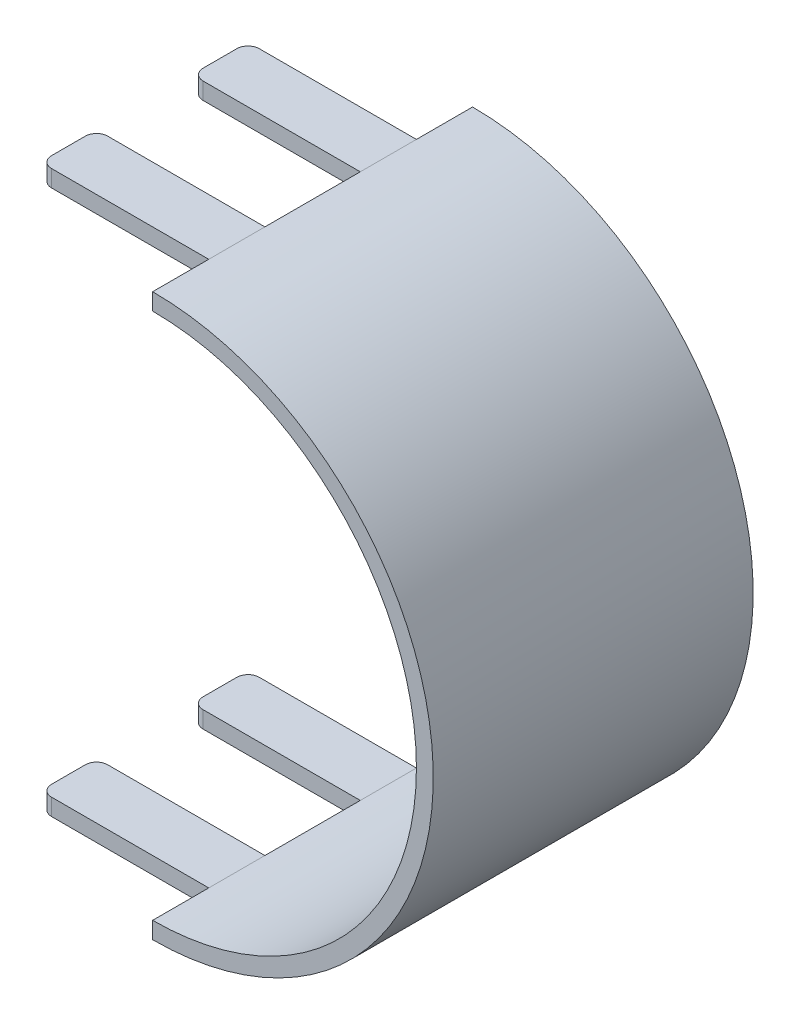
ISO-10303-21;
HEADER;
FILE_DESCRIPTION(('STEP AP214'),'2;1');
FILE_NAME('part.step','',(''),(''),'','','');
FILE_SCHEMA(('AUTOMOTIVE_DESIGN { 1 0 10303 214 1 1 1 1 }'));
ENDSEC;
DATA;
#1=APPLICATION_CONTEXT('core data for automotive mechanical design processes');
#2=APPLICATION_PROTOCOL_DEFINITION('international standard','automotive_design',2000,#1);
#3=PRODUCT_CONTEXT('',#1,'mechanical');
#4=PRODUCT('Part','Part','',(#3));
#5=PRODUCT_RELATED_PRODUCT_CATEGORY('part','',(#4));
#6=PRODUCT_DEFINITION_FORMATION('','',#4);
#7=PRODUCT_DEFINITION_CONTEXT('part definition',#1,'design');
#8=PRODUCT_DEFINITION('design','',#6,#7);
#9=PRODUCT_DEFINITION_SHAPE('','',#8);
#10=(LENGTH_UNIT() NAMED_UNIT(*) SI_UNIT(.MILLI.,.METRE.));
#11=(NAMED_UNIT(*) PLANE_ANGLE_UNIT() SI_UNIT($,.RADIAN.));
#12=(NAMED_UNIT(*) SI_UNIT($,.STERADIAN.) SOLID_ANGLE_UNIT());
#13=UNCERTAINTY_MEASURE_WITH_UNIT(LENGTH_MEASURE(1.E-05),#10,'distance_accuracy_value','');
#14=(GEOMETRIC_REPRESENTATION_CONTEXT(3) GLOBAL_UNCERTAINTY_ASSIGNED_CONTEXT((#13)) GLOBAL_UNIT_ASSIGNED_CONTEXT((#10,
#11,#12)) REPRESENTATION_CONTEXT('',''));
#15=CARTESIAN_POINT('',(0.,0.,0.));
#16=DIRECTION('',(0.,0.,1.));
#17=DIRECTION('',(1.,0.,0.));
#18=AXIS2_PLACEMENT_3D('',#15,#16,#17);
#19=CARTESIAN_POINT('',(300.,0.,60.));
#20=DIRECTION('',(0.,0.,-1.));
#21=DIRECTION('',(-1.,0.,0.));
#22=AXIS2_PLACEMENT_3D('',#19,#20,#21);
#23=CYLINDRICAL_SURFACE('',#22,50.);
#24=DIRECTION('',(0.,0.,-1.));
#25=VECTOR('',#24,1.);
#26=CARTESIAN_POINT('',(300.,-50.,60.));
#27=LINE('',#26,#25);
#28=CARTESIAN_POINT('',(300.,-50.,60.));
#29=VERTEX_POINT('',#28);
#30=CARTESIAN_POINT('',(300.,-50.,50.));
#31=VERTEX_POINT('',#30);
#32=EDGE_CURVE('E340',#29,#31,#27,.T.);
#33=ORIENTED_EDGE('',*,*,#32,.T.);
#34=DIRECTION('',(0.,0.,-1.));
#35=VECTOR('',#34,1.);
#36=CARTESIAN_POINT('',(300.,-50.,60.));
#37=LINE('',#36,#35);
#38=CARTESIAN_POINT('',(300.,-50.,40.));
#39=VERTEX_POINT('',#38);
#40=EDGE_CURVE('E260',#31,#39,#37,.T.);
#41=ORIENTED_EDGE('',*,*,#40,.T.);
#42=CARTESIAN_POINT('',(300.,-50.,23.));
#43=VERTEX_POINT('',#42);
#44=EDGE_CURVE('E350',#39,#43,#27,.T.);
#45=ORIENTED_EDGE('',*,*,#44,.T.);
#46=DIRECTION('',(0.,0.,-1.));
#47=VECTOR('',#46,1.);
#48=CARTESIAN_POINT('',(300.,-50.,60.));
#49=LINE('',#48,#47);
#50=CARTESIAN_POINT('',(300.,-50.,13.));
#51=VERTEX_POINT('',#50);
#52=EDGE_CURVE('E257',#43,#51,#49,.T.);
#53=ORIENTED_EDGE('',*,*,#52,.T.);
#54=CARTESIAN_POINT('',(300.,-50.,3.));
#55=VERTEX_POINT('',#54);
#56=EDGE_CURVE('E351',#51,#55,#27,.T.);
#57=ORIENTED_EDGE('',*,*,#56,.T.);
#58=CARTESIAN_POINT('',(300.,0.,3.));
#59=DIRECTION('',(0.,0.,1.));
#60=DIRECTION('',(1.,0.,0.));
#61=AXIS2_PLACEMENT_3D('',#58,#59,#60);
#62=CIRCLE('',#61,50.);
#63=CARTESIAN_POINT('',(300.,50.,3.));
#64=VERTEX_POINT('',#63);
#65=EDGE_CURVE('E344',#55,#64,#62,.T.);
#66=ORIENTED_EDGE('',*,*,#65,.T.);
#67=DIRECTION('',(0.,0.,-1.));
#68=VECTOR('',#67,1.);
#69=CARTESIAN_POINT('',(300.,50.,60.));
#70=LINE('',#69,#68);
#71=CARTESIAN_POINT('',(300.,50.,13.));
#72=VERTEX_POINT('',#71);
#73=EDGE_CURVE('E231',#72,#64,#70,.T.);
#74=ORIENTED_EDGE('',*,*,#73,.F.);
#75=DIRECTION('',(0.,0.,-1.));
#76=VECTOR('',#75,1.);
#77=CARTESIAN_POINT('',(300.,50.,60.));
#78=LINE('',#77,#76);
#79=CARTESIAN_POINT('',(300.,50.,23.));
#80=VERTEX_POINT('',#79);
#81=EDGE_CURVE('E235',#80,#72,#78,.T.);
#82=ORIENTED_EDGE('',*,*,#81,.F.);
#83=CARTESIAN_POINT('',(300.,50.,40.));
#84=VERTEX_POINT('',#83);
#85=EDGE_CURVE('E219',#84,#80,#70,.T.);
#86=ORIENTED_EDGE('',*,*,#85,.F.);
#87=DIRECTION('',(0.,0.,-1.));
#88=VECTOR('',#87,1.);
#89=CARTESIAN_POINT('',(300.,50.,60.));
#90=LINE('',#89,#88);
#91=CARTESIAN_POINT('',(300.,50.,50.));
#92=VERTEX_POINT('',#91);
#93=EDGE_CURVE('E316',#92,#84,#90,.T.);
#94=ORIENTED_EDGE('',*,*,#93,.F.);
#95=CARTESIAN_POINT('',(300.,50.,60.));
#96=VERTEX_POINT('',#95);
#97=EDGE_CURVE('E230',#96,#92,#70,.T.);
#98=ORIENTED_EDGE('',*,*,#97,.F.);
#99=CARTESIAN_POINT('',(300.,0.,60.));
#100=DIRECTION('',(0.,0.,1.));
#101=DIRECTION('',(1.,0.,0.));
#102=AXIS2_PLACEMENT_3D('',#99,#100,#101);
#103=CIRCLE('',#102,50.);
#104=EDGE_CURVE('E337',#29,#96,#103,.T.);
#105=ORIENTED_EDGE('',*,*,#104,.F.);
#106=EDGE_LOOP('',(#33,#41,#45,#53,#57,#66,#74,#82,#86,#94,#98,#105));
#107=FACE_BOUND('',#106,.T.);
#108=ADVANCED_FACE('F33',(#107),#23,.T.);
#109=CARTESIAN_POINT('',(300.,47.,3.));
#110=DIRECTION('',(0.,1.,0.));
#111=DIRECTION('',(0.,0.,1.));
#112=AXIS2_PLACEMENT_3D('',#109,#110,#111);
#113=PLANE('',#112);
#114=DIRECTION('',(0.,0.,1.));
#115=VECTOR('',#114,1.);
#116=CARTESIAN_POINT('',(270.,47.,3.));
#117=LINE('',#116,#115);
#118=CARTESIAN_POINT('',(270.,47.,15.));
#119=VERTEX_POINT('',#118);
#120=CARTESIAN_POINT('',(270.,47.,21.));
#121=VERTEX_POINT('',#120);
#122=EDGE_CURVE('E439',#119,#121,#117,.T.);
#123=ORIENTED_EDGE('',*,*,#122,.F.);
#124=CARTESIAN_POINT('',(272.,47.,15.));
#125=DIRECTION('',(0.,1.,0.));
#126=DIRECTION('',(0.,0.,1.));
#127=AXIS2_PLACEMENT_3D('',#124,#125,#126);
#128=CIRCLE('',#127,2.);
#129=CARTESIAN_POINT('',(272.,47.,13.));
#130=VERTEX_POINT('',#129);
#131=EDGE_CURVE('E41',#119,#130,#128,.F.);
#132=ORIENTED_EDGE('',*,*,#131,.T.);
#133=DIRECTION('',(-1.,0.,0.));
#134=VECTOR('',#133,1.);
#135=CARTESIAN_POINT('',(300.,47.,13.));
#136=LINE('',#135,#134);
#137=CARTESIAN_POINT('',(300.,47.,13.));
#138=VERTEX_POINT('',#137);
#139=EDGE_CURVE('E242',#138,#130,#136,.T.);
#140=ORIENTED_EDGE('',*,*,#139,.F.);
#141=DIRECTION('',(0.,0.,1.));
#142=VECTOR('',#141,1.);
#143=CARTESIAN_POINT('',(300.,47.,3.));
#144=LINE('',#143,#142);
#145=CARTESIAN_POINT('',(300.,47.,23.));
#146=VERTEX_POINT('',#145);
#147=EDGE_CURVE('E241',#138,#146,#144,.T.);
#148=ORIENTED_EDGE('',*,*,#147,.T.);
#149=DIRECTION('',(1.,0.,0.));
#150=VECTOR('',#149,1.);
#151=CARTESIAN_POINT('',(300.,47.,23.));
#152=LINE('',#151,#150);
#153=CARTESIAN_POINT('',(272.,47.,23.));
#154=VERTEX_POINT('',#153);
#155=EDGE_CURVE('E252',#154,#146,#152,.T.);
#156=ORIENTED_EDGE('',*,*,#155,.F.);
#157=CARTESIAN_POINT('',(272.,47.,21.));
#158=DIRECTION('',(0.,1.,0.));
#159=DIRECTION('',(0.,0.,1.));
#160=AXIS2_PLACEMENT_3D('',#157,#158,#159);
#161=CIRCLE('',#160,2.);
#162=EDGE_CURVE('E53',#154,#121,#161,.F.);
#163=ORIENTED_EDGE('',*,*,#162,.T.);
#164=EDGE_LOOP('',(#123,#132,#140,#148,#156,#163));
#165=FACE_BOUND('',#164,.T.);
#166=ADVANCED_FACE('F437',(#165),#113,.F.);
#167=CARTESIAN_POINT('',(300.,47.,3.));
#168=DIRECTION('',(0.,1.,0.));
#169=DIRECTION('',(0.,0.,1.));
#170=AXIS2_PLACEMENT_3D('',#167,#168,#169);
#171=PLANE('',#170);
#172=DIRECTION('',(1.,0.,0.));
#173=VECTOR('',#172,1.);
#174=CARTESIAN_POINT('',(300.,47.,50.));
#175=LINE('',#174,#173);
#176=CARTESIAN_POINT('',(272.,47.,50.));
#177=VERTEX_POINT('',#176);
#178=CARTESIAN_POINT('',(300.,47.,50.));
#179=VERTEX_POINT('',#178);
#180=EDGE_CURVE('E324',#177,#179,#175,.T.);
#181=ORIENTED_EDGE('',*,*,#180,.F.);
#182=CARTESIAN_POINT('',(272.,47.,48.));
#183=DIRECTION('',(0.,1.,0.));
#184=DIRECTION('',(0.,0.,1.));
#185=AXIS2_PLACEMENT_3D('',#182,#183,#184);
#186=CIRCLE('',#185,2.);
#187=CARTESIAN_POINT('',(270.,47.,48.));
#188=VERTEX_POINT('',#187);
#189=EDGE_CURVE('E418',#177,#188,#186,.F.);
#190=ORIENTED_EDGE('',*,*,#189,.T.);
#191=DIRECTION('',(0.,0.,1.));
#192=VECTOR('',#191,1.);
#193=CARTESIAN_POINT('',(270.,47.,3.));
#194=LINE('',#193,#192);
#195=CARTESIAN_POINT('',(270.,47.,42.));
#196=VERTEX_POINT('',#195);
#197=EDGE_CURVE('E321',#196,#188,#194,.T.);
#198=ORIENTED_EDGE('',*,*,#197,.F.);
#199=CARTESIAN_POINT('',(272.,47.,42.));
#200=DIRECTION('',(0.,1.,0.));
#201=DIRECTION('',(0.,0.,1.));
#202=AXIS2_PLACEMENT_3D('',#199,#200,#201);
#203=CIRCLE('',#202,2.);
#204=CARTESIAN_POINT('',(272.,47.,40.));
#205=VERTEX_POINT('',#204);
#206=EDGE_CURVE('E416',#196,#205,#203,.F.);
#207=ORIENTED_EDGE('',*,*,#206,.T.);
#208=DIRECTION('',(-1.,0.,0.));
#209=VECTOR('',#208,1.);
#210=CARTESIAN_POINT('',(300.,47.,40.));
#211=LINE('',#210,#209);
#212=CARTESIAN_POINT('',(300.,47.,40.));
#213=VERTEX_POINT('',#212);
#214=EDGE_CURVE('E318',#213,#205,#211,.T.);
#215=ORIENTED_EDGE('',*,*,#214,.F.);
#216=DIRECTION('',(0.,0.,1.));
#217=VECTOR('',#216,1.);
#218=CARTESIAN_POINT('',(300.,47.,3.));
#219=LINE('',#218,#217);
#220=EDGE_CURVE('E312',#213,#179,#219,.T.);
#221=ORIENTED_EDGE('',*,*,#220,.T.);
#222=EDGE_LOOP('',(#181,#190,#198,#207,#215,#221));
#223=FACE_BOUND('',#222,.T.);
#224=ADVANCED_FACE('F557',(#223),#171,.F.);
#225=CARTESIAN_POINT('',(-300.,-47.,3.));
#226=DIRECTION('',(0.,-1.,0.));
#227=DIRECTION('',(0.,0.,-1.));
#228=AXIS2_PLACEMENT_3D('',#225,#226,#227);
#229=PLANE('',#228);
#230=DIRECTION('',(0.,0.,-1.));
#231=VECTOR('',#230,1.);
#232=CARTESIAN_POINT('',(270.,-47.,3.));
#233=LINE('',#232,#231);
#234=CARTESIAN_POINT('',(270.,-47.,48.));
#235=VERTEX_POINT('',#234);
#236=CARTESIAN_POINT('',(270.,-47.,42.));
#237=VERTEX_POINT('',#236);
#238=EDGE_CURVE('E298',#235,#237,#233,.T.);
#239=ORIENTED_EDGE('',*,*,#238,.F.);
#240=CARTESIAN_POINT('',(272.,-47.,48.));
#241=DIRECTION('',(0.,-1.,0.));
#242=DIRECTION('',(0.,0.,-1.));
#243=AXIS2_PLACEMENT_3D('',#240,#241,#242);
#244=CIRCLE('',#243,2.);
#245=CARTESIAN_POINT('',(272.,-47.,50.));
#246=VERTEX_POINT('',#245);
#247=EDGE_CURVE('E376',#235,#246,#244,.F.);
#248=ORIENTED_EDGE('',*,*,#247,.T.);
#249=DIRECTION('',(-1.,0.,0.));
#250=VECTOR('',#249,1.);
#251=CARTESIAN_POINT('',(-300.,-47.,50.));
#252=LINE('',#251,#250);
#253=CARTESIAN_POINT('',(300.,-47.,50.));
#254=VERTEX_POINT('',#253);
#255=EDGE_CURVE('E297',#254,#246,#252,.T.);
#256=ORIENTED_EDGE('',*,*,#255,.F.);
#257=DIRECTION('',(0.,0.,1.));
#258=VECTOR('',#257,1.);
#259=CARTESIAN_POINT('',(300.,-47.,3.));
#260=LINE('',#259,#258);
#261=CARTESIAN_POINT('',(300.,-47.,40.));
#262=VERTEX_POINT('',#261);
#263=EDGE_CURVE('E285',#262,#254,#260,.T.);
#264=ORIENTED_EDGE('',*,*,#263,.F.);
#265=DIRECTION('',(1.,0.,0.));
#266=VECTOR('',#265,1.);
#267=CARTESIAN_POINT('',(-300.,-47.,40.));
#268=LINE('',#267,#266);
#269=CARTESIAN_POINT('',(272.,-47.,40.));
#270=VERTEX_POINT('',#269);
#271=EDGE_CURVE('E301',#270,#262,#268,.T.);
#272=ORIENTED_EDGE('',*,*,#271,.F.);
#273=CARTESIAN_POINT('',(272.,-47.,42.));
#274=DIRECTION('',(0.,-1.,0.));
#275=DIRECTION('',(0.,0.,-1.));
#276=AXIS2_PLACEMENT_3D('',#273,#274,#275);
#277=CIRCLE('',#276,2.);
#278=EDGE_CURVE('E374',#270,#237,#277,.F.);
#279=ORIENTED_EDGE('',*,*,#278,.T.);
#280=EDGE_LOOP('',(#239,#248,#256,#264,#272,#279));
#281=FACE_BOUND('',#280,.T.);
#282=ADVANCED_FACE('F524',(#281),#229,.F.);
#283=CARTESIAN_POINT('',(-300.,-47.,3.));
#284=DIRECTION('',(0.,-1.,0.));
#285=DIRECTION('',(0.,0.,-1.));
#286=AXIS2_PLACEMENT_3D('',#283,#284,#285);
#287=PLANE('',#286);
#288=DIRECTION('',(0.,0.,-1.));
#289=VECTOR('',#288,1.);
#290=CARTESIAN_POINT('',(270.,-47.,3.));
#291=LINE('',#290,#289);
#292=CARTESIAN_POINT('',(270.,-47.,21.));
#293=VERTEX_POINT('',#292);
#294=CARTESIAN_POINT('',(270.,-47.,15.));
#295=VERTEX_POINT('',#294);
#296=EDGE_CURVE('E273',#293,#295,#291,.T.);
#297=ORIENTED_EDGE('',*,*,#296,.F.);
#298=CARTESIAN_POINT('',(272.,-47.,21.));
#299=DIRECTION('',(0.,-1.,0.));
#300=DIRECTION('',(0.,0.,-1.));
#301=AXIS2_PLACEMENT_3D('',#298,#299,#300);
#302=CIRCLE('',#301,2.);
#303=CARTESIAN_POINT('',(272.,-47.,23.));
#304=VERTEX_POINT('',#303);
#305=EDGE_CURVE('E394',#293,#304,#302,.F.);
#306=ORIENTED_EDGE('',*,*,#305,.T.);
#307=DIRECTION('',(-1.,0.,0.));
#308=VECTOR('',#307,1.);
#309=CARTESIAN_POINT('',(-300.,-47.,23.));
#310=LINE('',#309,#308);
#311=CARTESIAN_POINT('',(300.,-47.,23.));
#312=VERTEX_POINT('',#311);
#313=EDGE_CURVE('E270',#312,#304,#310,.T.);
#314=ORIENTED_EDGE('',*,*,#313,.F.);
#315=DIRECTION('',(0.,0.,1.));
#316=VECTOR('',#315,1.);
#317=CARTESIAN_POINT('',(300.,-47.,3.));
#318=LINE('',#317,#316);
#319=CARTESIAN_POINT('',(300.,-47.,13.));
#320=VERTEX_POINT('',#319);
#321=EDGE_CURVE('E261',#320,#312,#318,.T.);
#322=ORIENTED_EDGE('',*,*,#321,.F.);
#323=DIRECTION('',(1.,0.,0.));
#324=VECTOR('',#323,1.);
#325=CARTESIAN_POINT('',(-300.,-47.,13.));
#326=LINE('',#325,#324);
#327=CARTESIAN_POINT('',(272.,-47.,13.));
#328=VERTEX_POINT('',#327);
#329=EDGE_CURVE('E276',#328,#320,#326,.T.);
#330=ORIENTED_EDGE('',*,*,#329,.F.);
#331=CARTESIAN_POINT('',(272.,-47.,15.));
#332=DIRECTION('',(0.,-1.,0.));
#333=DIRECTION('',(0.,0.,-1.));
#334=AXIS2_PLACEMENT_3D('',#331,#332,#333);
#335=CIRCLE('',#334,2.);
#336=EDGE_CURVE('E392',#328,#295,#335,.F.);
#337=ORIENTED_EDGE('',*,*,#336,.T.);
#338=EDGE_LOOP('',(#297,#306,#314,#322,#330,#337));
#339=FACE_BOUND('',#338,.T.);
#340=ADVANCED_FACE('F479',(#339),#287,.F.);
#341=CARTESIAN_POINT('',(270.,-50.01,13.));
#342=DIRECTION('',(-1.,0.,0.));
#343=DIRECTION('',(0.,0.,1.));
#344=AXIS2_PLACEMENT_3D('',#341,#342,#343);
#345=PLANE('',#344);
#346=DIRECTION('',(0.,0.,1.));
#347=VECTOR('',#346,1.);
#348=CARTESIAN_POINT('',(270.,-50.,60.));
#349=LINE('',#348,#347);
#350=CARTESIAN_POINT('',(270.,-50.,15.));
#351=VERTEX_POINT('',#350);
#352=CARTESIAN_POINT('',(270.,-50.,21.));
#353=VERTEX_POINT('',#352);
#354=EDGE_CURVE('E280',#351,#353,#349,.T.);
#355=ORIENTED_EDGE('',*,*,#354,.T.);
#356=DIRECTION('',(0.,1.,0.));
#357=VECTOR('',#356,1.);
#358=CARTESIAN_POINT('',(270.,-50.01,21.));
#359=LINE('',#358,#357);
#360=EDGE_CURVE('E389',#353,#293,#359,.T.);
#361=ORIENTED_EDGE('',*,*,#360,.T.);
#362=ORIENTED_EDGE('',*,*,#296,.T.);
#363=DIRECTION('',(0.,1.,0.));
#364=VECTOR('',#363,1.);
#365=CARTESIAN_POINT('',(270.,-50.01,15.));
#366=LINE('',#365,#364);
#367=EDGE_CURVE('E387',#295,#351,#366,.F.);
#368=ORIENTED_EDGE('',*,*,#367,.T.);
#369=EDGE_LOOP('',(#355,#361,#362,#368));
#370=FACE_BOUND('',#369,.T.);
#371=ADVANCED_FACE('F695',(#370),#345,.T.);
#372=CARTESIAN_POINT('',(300.,-50.01,23.));
#373=DIRECTION('',(0.,0.,1.));
#374=DIRECTION('',(1.,0.,0.));
#375=AXIS2_PLACEMENT_3D('',#372,#373,#374);
#376=PLANE('',#375);
#377=ORIENTED_EDGE('',*,*,#313,.T.);
#378=DIRECTION('',(0.,1.,0.));
#379=VECTOR('',#378,1.);
#380=CARTESIAN_POINT('',(272.,-50.01,23.));
#381=LINE('',#380,#379);
#382=CARTESIAN_POINT('',(272.,-50.,23.));
#383=VERTEX_POINT('',#382);
#384=EDGE_CURVE('E396',#304,#383,#381,.F.);
#385=ORIENTED_EDGE('',*,*,#384,.T.);
#386=DIRECTION('',(1.,0.,0.));
#387=VECTOR('',#386,1.);
#388=CARTESIAN_POINT('',(-300.,-50.,23.));
#389=LINE('',#388,#387);
#390=EDGE_CURVE('E278',#383,#43,#389,.T.);
#391=ORIENTED_EDGE('',*,*,#390,.T.);
#392=DIRECTION('',(0.,1.,0.));
#393=VECTOR('',#392,1.);
#394=CARTESIAN_POINT('',(300.,1.71683972880179E-13,23.));
#395=LINE('',#394,#393);
#396=EDGE_CURVE('E264',#43,#312,#395,.T.);
#397=ORIENTED_EDGE('',*,*,#396,.T.);
#398=EDGE_LOOP('',(#377,#385,#391,#397));
#399=FACE_BOUND('',#398,.T.);
#400=ADVANCED_FACE('F483',(#399),#376,.T.);
#401=CARTESIAN_POINT('',(300.,-50.01,13.));
#402=DIRECTION('',(0.,0.,-1.));
#403=DIRECTION('',(-1.,0.,0.));
#404=AXIS2_PLACEMENT_3D('',#401,#402,#403);
#405=PLANE('',#404);
#406=DIRECTION('',(-1.,0.,0.));
#407=VECTOR('',#406,1.);
#408=CARTESIAN_POINT('',(-300.,-50.,13.));
#409=LINE('',#408,#407);
#410=CARTESIAN_POINT('',(272.,-50.,13.));
#411=VERTEX_POINT('',#410);
#412=EDGE_CURVE('E263',#51,#411,#409,.T.);
#413=ORIENTED_EDGE('',*,*,#412,.T.);
#414=DIRECTION('',(0.,1.,0.));
#415=VECTOR('',#414,1.);
#416=CARTESIAN_POINT('',(272.,-50.01,13.));
#417=LINE('',#416,#415);
#418=EDGE_CURVE('E402',#411,#328,#417,.T.);
#419=ORIENTED_EDGE('',*,*,#418,.T.);
#420=ORIENTED_EDGE('',*,*,#329,.T.);
#421=DIRECTION('',(0.,-1.,0.));
#422=VECTOR('',#421,1.);
#423=CARTESIAN_POINT('',(300.,1.71683972880179E-13,13.));
#424=LINE('',#423,#422);
#425=EDGE_CURVE('E267',#320,#51,#424,.T.);
#426=ORIENTED_EDGE('',*,*,#425,.T.);
#427=EDGE_LOOP('',(#413,#419,#420,#426));
#428=FACE_BOUND('',#427,.T.);
#429=ADVANCED_FACE('F500',(#428),#405,.T.);
#430=CARTESIAN_POINT('',(-300.,-50.,60.));
#431=DIRECTION('',(0.,1.,0.));
#432=DIRECTION('',(0.,0.,1.));
#433=AXIS2_PLACEMENT_3D('',#430,#431,#432);
#434=PLANE('',#433);
#435=ORIENTED_EDGE('',*,*,#390,.F.);
#436=CARTESIAN_POINT('',(272.,-50.,21.));
#437=DIRECTION('',(0.,1.,0.));
#438=DIRECTION('',(0.,0.,1.));
#439=AXIS2_PLACEMENT_3D('',#436,#437,#438);
#440=CIRCLE('',#439,2.);
#441=EDGE_CURVE('E400',#383,#353,#440,.F.);
#442=ORIENTED_EDGE('',*,*,#441,.T.);
#443=ORIENTED_EDGE('',*,*,#354,.F.);
#444=CARTESIAN_POINT('',(272.,-50.,15.));
#445=DIRECTION('',(0.,1.,0.));
#446=DIRECTION('',(0.,0.,1.));
#447=AXIS2_PLACEMENT_3D('',#444,#445,#446);
#448=CIRCLE('',#447,2.);
#449=EDGE_CURVE('E398',#351,#411,#448,.F.);
#450=ORIENTED_EDGE('',*,*,#449,.T.);
#451=ORIENTED_EDGE('',*,*,#412,.F.);
#452=ORIENTED_EDGE('',*,*,#52,.F.);
#453=EDGE_LOOP('',(#435,#442,#443,#450,#451,#452));
#454=FACE_BOUND('',#453,.T.);
#455=ADVANCED_FACE('F494',(#454),#434,.F.);
#456=CARTESIAN_POINT('',(300.,1.71683972880179E-13,0.));
#457=DIRECTION('',(-1.,0.,0.));
#458=DIRECTION('',(0.,-1.,0.));
#459=AXIS2_PLACEMENT_3D('',#456,#457,#458);
#460=PLANE('',#459);
#461=ORIENTED_EDGE('',*,*,#425,.F.);
#462=DIRECTION('',(0.,0.,1.));
#463=VECTOR('',#462,1.);
#464=CARTESIAN_POINT('',(300.,-47.,3.));
#465=LINE('',#464,#463);
#466=CARTESIAN_POINT('',(300.,-47.,3.));
#467=VERTEX_POINT('',#466);
#468=EDGE_CURVE('E345',#467,#320,#465,.T.);
#469=ORIENTED_EDGE('',*,*,#468,.F.);
#470=DIRECTION('',(0.,1.,0.));
#471=VECTOR('',#470,1.);
#472=CARTESIAN_POINT('',(300.,1.71683972880179E-13,3.));
#473=LINE('',#472,#471);
#474=EDGE_CURVE('E362',#55,#467,#473,.T.);
#475=ORIENTED_EDGE('',*,*,#474,.F.);
#476=ORIENTED_EDGE('',*,*,#56,.F.);
#477=EDGE_LOOP('',(#461,#469,#475,#476));
#478=FACE_BOUND('',#477,.T.);
#479=ADVANCED_FACE('F501',(#478),#460,.T.);
#480=CARTESIAN_POINT('',(0.,0.,3.));
#481=DIRECTION('',(0.,0.,1.));
#482=DIRECTION('',(1.,0.,0.));
#483=AXIS2_PLACEMENT_3D('',#480,#481,#482);
#484=PLANE('',#483);
#485=DIRECTION('',(0.,1.,0.));
#486=VECTOR('',#485,1.);
#487=CARTESIAN_POINT('',(300.,1.71683972880179E-13,3.));
#488=LINE('',#487,#486);
#489=CARTESIAN_POINT('',(300.,47.,3.));
#490=VERTEX_POINT('',#489);
#491=EDGE_CURVE('E366',#490,#64,#488,.T.);
#492=ORIENTED_EDGE('',*,*,#491,.T.);
#493=ORIENTED_EDGE('',*,*,#65,.F.);
#494=ORIENTED_EDGE('',*,*,#474,.T.);
#495=CARTESIAN_POINT('',(300.,0.,3.));
#496=DIRECTION('',(0.,0.,1.));
#497=DIRECTION('',(1.,0.,0.));
#498=AXIS2_PLACEMENT_3D('',#495,#496,#497);
#499=CIRCLE('',#498,47.);
#500=EDGE_CURVE('E361',#490,#467,#499,.F.);
#501=ORIENTED_EDGE('',*,*,#500,.F.);
#502=EDGE_LOOP('',(#492,#493,#494,#501));
#503=FACE_BOUND('',#502,.T.);
#504=ADVANCED_FACE('F467',(#503),#484,.F.);
#505=CARTESIAN_POINT('',(300.,0.,3.));
#506=DIRECTION('',(0.,0.,1.));
#507=DIRECTION('',(1.,0.,0.));
#508=AXIS2_PLACEMENT_3D('',#505,#506,#507);
#509=CYLINDRICAL_SURFACE('',#508,47.);
#510=DIRECTION('',(0.,0.,1.));
#511=VECTOR('',#510,1.);
#512=CARTESIAN_POINT('',(300.,47.,3.));
#513=LINE('',#512,#511);
#514=EDGE_CURVE('E352',#490,#138,#513,.T.);
#515=ORIENTED_EDGE('',*,*,#514,.F.);
#516=ORIENTED_EDGE('',*,*,#500,.T.);
#517=ORIENTED_EDGE('',*,*,#468,.T.);
#518=ORIENTED_EDGE('',*,*,#321,.T.);
#519=EDGE_CURVE('E348',#312,#262,#465,.T.);
#520=ORIENTED_EDGE('',*,*,#519,.T.);
#521=ORIENTED_EDGE('',*,*,#263,.T.);
#522=CARTESIAN_POINT('',(300.,-47.,60.));
#523=VERTEX_POINT('',#522);
#524=EDGE_CURVE('E339',#254,#523,#465,.T.);
#525=ORIENTED_EDGE('',*,*,#524,.T.);
#526=CARTESIAN_POINT('',(300.,0.,60.));
#527=DIRECTION('',(0.,0.,1.));
#528=DIRECTION('',(1.,0.,0.));
#529=AXIS2_PLACEMENT_3D('',#526,#527,#528);
#530=CIRCLE('',#529,47.);
#531=CARTESIAN_POINT('',(300.,47.,60.));
#532=VERTEX_POINT('',#531);
#533=EDGE_CURVE('E341',#523,#532,#530,.T.);
#534=ORIENTED_EDGE('',*,*,#533,.T.);
#535=EDGE_CURVE('E315',#179,#532,#513,.T.);
#536=ORIENTED_EDGE('',*,*,#535,.F.);
#537=ORIENTED_EDGE('',*,*,#220,.F.);
#538=EDGE_CURVE('E354',#146,#213,#513,.T.);
#539=ORIENTED_EDGE('',*,*,#538,.F.);
#540=ORIENTED_EDGE('',*,*,#147,.F.);
#541=EDGE_LOOP('',(#515,#516,#517,#518,#520,#521,#525,#534,#536,#537,#539,#540));
#542=FACE_BOUND('',#541,.T.);
#543=ADVANCED_FACE('F460',(#542),#509,.F.);
#544=CARTESIAN_POINT('',(-300.,0.,60.));
#545=DIRECTION('',(0.,0.,1.));
#546=DIRECTION('',(1.,0.,0.));
#547=AXIS2_PLACEMENT_3D('',#544,#545,#546);
#548=PLANE('',#547);
#549=ORIENTED_EDGE('',*,*,#104,.T.);
#550=DIRECTION('',(0.,-1.,0.));
#551=VECTOR('',#550,1.);
#552=CARTESIAN_POINT('',(300.,3.43367945760358E-13,60.));
#553=LINE('',#552,#551);
#554=EDGE_CURVE('E356',#96,#532,#553,.T.);
#555=ORIENTED_EDGE('',*,*,#554,.T.);
#556=ORIENTED_EDGE('',*,*,#533,.F.);
#557=EDGE_CURVE('E359',#523,#29,#553,.T.);
#558=ORIENTED_EDGE('',*,*,#557,.T.);
#559=EDGE_LOOP('',(#549,#555,#556,#558));
#560=FACE_BOUND('',#559,.T.);
#561=ADVANCED_FACE('F507',(#560),#548,.T.);
#562=CARTESIAN_POINT('',(270.,-50.01,40.));
#563=DIRECTION('',(-1.,0.,0.));
#564=DIRECTION('',(0.,0.,1.));
#565=AXIS2_PLACEMENT_3D('',#562,#563,#564);
#566=PLANE('',#565);
#567=DIRECTION('',(0.,0.,1.));
#568=VECTOR('',#567,1.);
#569=CARTESIAN_POINT('',(270.,-50.,60.));
#570=LINE('',#569,#568);
#571=CARTESIAN_POINT('',(270.,-50.,42.));
#572=VERTEX_POINT('',#571);
#573=CARTESIAN_POINT('',(270.,-50.,48.));
#574=VERTEX_POINT('',#573);
#575=EDGE_CURVE('E306',#572,#574,#570,.T.);
#576=ORIENTED_EDGE('',*,*,#575,.T.);
#577=DIRECTION('',(0.,1.,0.));
#578=VECTOR('',#577,1.);
#579=CARTESIAN_POINT('',(270.,-50.01,48.));
#580=LINE('',#579,#578);
#581=EDGE_CURVE('E371',#574,#235,#580,.T.);
#582=ORIENTED_EDGE('',*,*,#581,.T.);
#583=ORIENTED_EDGE('',*,*,#238,.T.);
#584=DIRECTION('',(0.,1.,0.));
#585=VECTOR('',#584,1.);
#586=CARTESIAN_POINT('',(270.,-50.01,42.));
#587=LINE('',#586,#585);
#588=EDGE_CURVE('E365',#237,#572,#587,.F.);
#589=ORIENTED_EDGE('',*,*,#588,.T.);
#590=EDGE_LOOP('',(#576,#582,#583,#589));
#591=FACE_BOUND('',#590,.T.);
#592=ADVANCED_FACE('F587',(#591),#566,.T.);
#593=CARTESIAN_POINT('',(300.,-50.01,50.));
#594=DIRECTION('',(0.,0.,1.));
#595=DIRECTION('',(1.,0.,0.));
#596=AXIS2_PLACEMENT_3D('',#593,#594,#595);
#597=PLANE('',#596);
#598=ORIENTED_EDGE('',*,*,#255,.T.);
#599=DIRECTION('',(0.,1.,0.));
#600=VECTOR('',#599,1.);
#601=CARTESIAN_POINT('',(272.,-50.01,50.));
#602=LINE('',#601,#600);
#603=CARTESIAN_POINT('',(272.,-50.,50.));
#604=VERTEX_POINT('',#603);
#605=EDGE_CURVE('E378',#246,#604,#602,.F.);
#606=ORIENTED_EDGE('',*,*,#605,.T.);
#607=DIRECTION('',(1.,0.,0.));
#608=VECTOR('',#607,1.);
#609=CARTESIAN_POINT('',(-300.,-50.,50.));
#610=LINE('',#609,#608);
#611=EDGE_CURVE('E304',#604,#31,#610,.T.);
#612=ORIENTED_EDGE('',*,*,#611,.T.);
#613=DIRECTION('',(0.,1.,0.));
#614=VECTOR('',#613,1.);
#615=CARTESIAN_POINT('',(300.,1.71683972880179E-13,50.));
#616=LINE('',#615,#614);
#617=EDGE_CURVE('E290',#31,#254,#616,.T.);
#618=ORIENTED_EDGE('',*,*,#617,.T.);
#619=EDGE_LOOP('',(#598,#606,#612,#618));
#620=FACE_BOUND('',#619,.T.);
#621=ADVANCED_FACE('F527',(#620),#597,.T.);
#622=CARTESIAN_POINT('',(300.,-50.01,40.));
#623=DIRECTION('',(0.,0.,-1.));
#624=DIRECTION('',(-1.,0.,0.));
#625=AXIS2_PLACEMENT_3D('',#622,#623,#624);
#626=PLANE('',#625);
#627=DIRECTION('',(-1.,0.,0.));
#628=VECTOR('',#627,1.);
#629=CARTESIAN_POINT('',(-300.,-50.,40.));
#630=LINE('',#629,#628);
#631=CARTESIAN_POINT('',(272.,-50.,40.));
#632=VERTEX_POINT('',#631);
#633=EDGE_CURVE('E287',#39,#632,#630,.T.);
#634=ORIENTED_EDGE('',*,*,#633,.T.);
#635=DIRECTION('',(0.,1.,0.));
#636=VECTOR('',#635,1.);
#637=CARTESIAN_POINT('',(272.,-50.01,40.));
#638=LINE('',#637,#636);
#639=EDGE_CURVE('E384',#632,#270,#638,.T.);
#640=ORIENTED_EDGE('',*,*,#639,.T.);
#641=ORIENTED_EDGE('',*,*,#271,.T.);
#642=DIRECTION('',(0.,-1.,0.));
#643=VECTOR('',#642,1.);
#644=CARTESIAN_POINT('',(300.,1.71683972880179E-13,40.));
#645=LINE('',#644,#643);
#646=EDGE_CURVE('E294',#262,#39,#645,.T.);
#647=ORIENTED_EDGE('',*,*,#646,.T.);
#648=EDGE_LOOP('',(#634,#640,#641,#647));
#649=FACE_BOUND('',#648,.T.);
#650=ADVANCED_FACE('F543',(#649),#626,.T.);
#651=CARTESIAN_POINT('',(-300.,-50.,60.));
#652=DIRECTION('',(0.,1.,0.));
#653=DIRECTION('',(0.,0.,1.));
#654=AXIS2_PLACEMENT_3D('',#651,#652,#653);
#655=PLANE('',#654);
#656=ORIENTED_EDGE('',*,*,#611,.F.);
#657=CARTESIAN_POINT('',(272.,-50.,48.));
#658=DIRECTION('',(0.,1.,0.));
#659=DIRECTION('',(0.,0.,1.));
#660=AXIS2_PLACEMENT_3D('',#657,#658,#659);
#661=CIRCLE('',#660,2.);
#662=EDGE_CURVE('E382',#604,#574,#661,.F.);
#663=ORIENTED_EDGE('',*,*,#662,.T.);
#664=ORIENTED_EDGE('',*,*,#575,.F.);
#665=CARTESIAN_POINT('',(272.,-50.,42.));
#666=DIRECTION('',(0.,1.,0.));
#667=DIRECTION('',(0.,0.,1.));
#668=AXIS2_PLACEMENT_3D('',#665,#666,#667);
#669=CIRCLE('',#668,2.);
#670=EDGE_CURVE('E380',#572,#632,#669,.F.);
#671=ORIENTED_EDGE('',*,*,#670,.T.);
#672=ORIENTED_EDGE('',*,*,#633,.F.);
#673=ORIENTED_EDGE('',*,*,#40,.F.);
#674=EDGE_LOOP('',(#656,#663,#664,#671,#672,#673));
#675=FACE_BOUND('',#674,.T.);
#676=ADVANCED_FACE('F532',(#675),#655,.F.);
#677=ORIENTED_EDGE('',*,*,#617,.F.);
#678=ORIENTED_EDGE('',*,*,#32,.F.);
#679=ORIENTED_EDGE('',*,*,#557,.F.);
#680=ORIENTED_EDGE('',*,*,#524,.F.);
#681=EDGE_LOOP('',(#677,#678,#679,#680));
#682=FACE_BOUND('',#681,.T.);
#683=ADVANCED_FACE('F529',(#682),#460,.T.);
#684=CARTESIAN_POINT('',(300.,46.99,50.));
#685=DIRECTION('',(0.,0.,1.));
#686=DIRECTION('',(1.,0.,0.));
#687=AXIS2_PLACEMENT_3D('',#684,#685,#686);
#688=PLANE('',#687);
#689=DIRECTION('',(-1.,0.,0.));
#690=VECTOR('',#689,1.);
#691=CARTESIAN_POINT('',(-300.,50.,50.));
#692=LINE('',#691,#690);
#693=CARTESIAN_POINT('',(272.,50.,50.));
#694=VERTEX_POINT('',#693);
#695=EDGE_CURVE('E331',#92,#694,#692,.T.);
#696=ORIENTED_EDGE('',*,*,#695,.T.);
#697=DIRECTION('',(0.,1.,0.));
#698=VECTOR('',#697,1.);
#699=CARTESIAN_POINT('',(272.,46.99,50.));
#700=LINE('',#699,#698);
#701=EDGE_CURVE('E414',#694,#177,#700,.F.);
#702=ORIENTED_EDGE('',*,*,#701,.T.);
#703=ORIENTED_EDGE('',*,*,#180,.T.);
#704=DIRECTION('',(0.,1.,0.));
#705=VECTOR('',#704,1.);
#706=CARTESIAN_POINT('',(300.,1.71683972880179E-13,50.));
#707=LINE('',#706,#705);
#708=EDGE_CURVE('E293',#179,#92,#707,.T.);
#709=ORIENTED_EDGE('',*,*,#708,.T.);
#710=EDGE_LOOP('',(#696,#702,#703,#709));
#711=FACE_BOUND('',#710,.T.);
#712=ADVANCED_FACE('F531',(#711),#688,.T.);
#713=CARTESIAN_POINT('',(270.,46.99,40.));
#714=DIRECTION('',(-1.,0.,0.));
#715=DIRECTION('',(0.,0.,1.));
#716=AXIS2_PLACEMENT_3D('',#713,#714,#715);
#717=PLANE('',#716);
#718=ORIENTED_EDGE('',*,*,#197,.T.);
#719=DIRECTION('',(0.,1.,0.));
#720=VECTOR('',#719,1.);
#721=CARTESIAN_POINT('',(270.,46.99,48.));
#722=LINE('',#721,#720);
#723=CARTESIAN_POINT('',(270.,50.,48.));
#724=VERTEX_POINT('',#723);
#725=EDGE_CURVE('E407',#188,#724,#722,.T.);
#726=ORIENTED_EDGE('',*,*,#725,.T.);
#727=DIRECTION('',(0.,0.,-1.));
#728=VECTOR('',#727,1.);
#729=CARTESIAN_POINT('',(270.,50.,60.));
#730=LINE('',#729,#728);
#731=CARTESIAN_POINT('',(270.,50.,42.));
#732=VERTEX_POINT('',#731);
#733=EDGE_CURVE('E328',#724,#732,#730,.T.);
#734=ORIENTED_EDGE('',*,*,#733,.T.);
#735=DIRECTION('',(0.,1.,0.));
#736=VECTOR('',#735,1.);
#737=CARTESIAN_POINT('',(270.,46.99,42.));
#738=LINE('',#737,#736);
#739=EDGE_CURVE('E405',#732,#196,#738,.F.);
#740=ORIENTED_EDGE('',*,*,#739,.T.);
#741=EDGE_LOOP('',(#718,#726,#734,#740));
#742=FACE_BOUND('',#741,.T.);
#743=ADVANCED_FACE('F539',(#742),#717,.T.);
#744=CARTESIAN_POINT('',(300.,46.99,40.));
#745=DIRECTION('',(0.,0.,-1.));
#746=DIRECTION('',(-1.,0.,0.));
#747=AXIS2_PLACEMENT_3D('',#744,#745,#746);
#748=PLANE('',#747);
#749=ORIENTED_EDGE('',*,*,#214,.T.);
#750=DIRECTION('',(0.,1.,0.));
#751=VECTOR('',#750,1.);
#752=CARTESIAN_POINT('',(272.,46.99,40.));
#753=LINE('',#752,#751);
#754=CARTESIAN_POINT('',(272.,50.,40.));
#755=VERTEX_POINT('',#754);
#756=EDGE_CURVE('E420',#205,#755,#753,.T.);
#757=ORIENTED_EDGE('',*,*,#756,.T.);
#758=DIRECTION('',(1.,0.,0.));
#759=VECTOR('',#758,1.);
#760=CARTESIAN_POINT('',(-300.,50.,40.));
#761=LINE('',#760,#759);
#762=EDGE_CURVE('E326',#755,#84,#761,.T.);
#763=ORIENTED_EDGE('',*,*,#762,.T.);
#764=DIRECTION('',(0.,-1.,0.));
#765=VECTOR('',#764,1.);
#766=CARTESIAN_POINT('',(300.,1.71683972880179E-13,40.));
#767=LINE('',#766,#765);
#768=EDGE_CURVE('E226',#84,#213,#767,.T.);
#769=ORIENTED_EDGE('',*,*,#768,.T.);
#770=EDGE_LOOP('',(#749,#757,#763,#769));
#771=FACE_BOUND('',#770,.T.);
#772=ADVANCED_FACE('F592',(#771),#748,.T.);
#773=CARTESIAN_POINT('',(-300.,50.,60.));
#774=DIRECTION('',(0.,-1.,0.));
#775=DIRECTION('',(0.,0.,-1.));
#776=AXIS2_PLACEMENT_3D('',#773,#774,#775);
#777=PLANE('',#776);
#778=ORIENTED_EDGE('',*,*,#733,.F.);
#779=CARTESIAN_POINT('',(272.,50.,48.));
#780=DIRECTION('',(0.,-1.,0.));
#781=DIRECTION('',(0.,0.,-1.));
#782=AXIS2_PLACEMENT_3D('',#779,#780,#781);
#783=CIRCLE('',#782,2.);
#784=EDGE_CURVE('E412',#724,#694,#783,.F.);
#785=ORIENTED_EDGE('',*,*,#784,.T.);
#786=ORIENTED_EDGE('',*,*,#695,.F.);
#787=ORIENTED_EDGE('',*,*,#93,.T.);
#788=ORIENTED_EDGE('',*,*,#762,.F.);
#789=CARTESIAN_POINT('',(272.,50.,42.));
#790=DIRECTION('',(0.,-1.,0.));
#791=DIRECTION('',(0.,0.,-1.));
#792=AXIS2_PLACEMENT_3D('',#789,#790,#791);
#793=CIRCLE('',#792,2.);
#794=EDGE_CURVE('E410',#755,#732,#793,.F.);
#795=ORIENTED_EDGE('',*,*,#794,.T.);
#796=EDGE_LOOP('',(#778,#785,#786,#787,#788,#795));
#797=FACE_BOUND('',#796,.T.);
#798=ADVANCED_FACE('F549',(#797),#777,.F.);
#799=ORIENTED_EDGE('',*,*,#708,.F.);
#800=ORIENTED_EDGE('',*,*,#535,.T.);
#801=ORIENTED_EDGE('',*,*,#554,.F.);
#802=ORIENTED_EDGE('',*,*,#97,.T.);
#803=EDGE_LOOP('',(#799,#800,#801,#802));
#804=FACE_BOUND('',#803,.T.);
#805=ADVANCED_FACE('F515',(#804),#460,.T.);
#806=CARTESIAN_POINT('',(300.,46.99,23.));
#807=DIRECTION('',(0.,0.,1.));
#808=DIRECTION('',(1.,0.,0.));
#809=AXIS2_PLACEMENT_3D('',#806,#807,#808);
#810=PLANE('',#809);
#811=DIRECTION('',(-1.,0.,0.));
#812=VECTOR('',#811,1.);
#813=CARTESIAN_POINT('',(-300.,50.,23.));
#814=LINE('',#813,#812);
#815=CARTESIAN_POINT('',(272.,50.,23.));
#816=VERTEX_POINT('',#815);
#817=EDGE_CURVE('E244',#80,#816,#814,.T.);
#818=ORIENTED_EDGE('',*,*,#817,.T.);
#819=DIRECTION('',(0.,1.,0.));
#820=VECTOR('',#819,1.);
#821=CARTESIAN_POINT('',(272.,46.99,23.));
#822=LINE('',#821,#820);
#823=EDGE_CURVE('E11',#816,#154,#822,.F.);
#824=ORIENTED_EDGE('',*,*,#823,.T.);
#825=ORIENTED_EDGE('',*,*,#155,.T.);
#826=DIRECTION('',(0.,1.,0.));
#827=VECTOR('',#826,1.);
#828=CARTESIAN_POINT('',(300.,1.71683972880179E-13,23.));
#829=LINE('',#828,#827);
#830=EDGE_CURVE('E223',#146,#80,#829,.T.);
#831=ORIENTED_EDGE('',*,*,#830,.T.);
#832=EDGE_LOOP('',(#818,#824,#825,#831));
#833=FACE_BOUND('',#832,.T.);
#834=ADVANCED_FACE('F251',(#833),#810,.T.);
#835=CARTESIAN_POINT('',(270.,46.99,13.));
#836=DIRECTION('',(-1.,0.,0.));
#837=DIRECTION('',(0.,0.,1.));
#838=AXIS2_PLACEMENT_3D('',#835,#836,#837);
#839=PLANE('',#838);
#840=DIRECTION('',(0.,0.,-1.));
#841=VECTOR('',#840,1.);
#842=CARTESIAN_POINT('',(270.,50.,60.));
#843=LINE('',#842,#841);
#844=CARTESIAN_POINT('',(270.,50.,21.));
#845=VERTEX_POINT('',#844);
#846=CARTESIAN_POINT('',(270.,50.,15.));
#847=VERTEX_POINT('',#846);
#848=EDGE_CURVE('E248',#845,#847,#843,.T.);
#849=ORIENTED_EDGE('',*,*,#848,.T.);
#850=DIRECTION('',(0.,1.,0.));
#851=VECTOR('',#850,1.);
#852=CARTESIAN_POINT('',(270.,46.99,15.));
#853=LINE('',#852,#851);
#854=EDGE_CURVE('E432',#847,#119,#853,.F.);
#855=ORIENTED_EDGE('',*,*,#854,.T.);
#856=ORIENTED_EDGE('',*,*,#122,.T.);
#857=DIRECTION('',(0.,1.,0.));
#858=VECTOR('',#857,1.);
#859=CARTESIAN_POINT('',(270.,46.99,21.));
#860=LINE('',#859,#858);
#861=EDGE_CURVE('E429',#121,#845,#860,.T.);
#862=ORIENTED_EDGE('',*,*,#861,.T.);
#863=EDGE_LOOP('',(#849,#855,#856,#862));
#864=FACE_BOUND('',#863,.T.);
#865=ADVANCED_FACE('F451',(#864),#839,.T.);
#866=CARTESIAN_POINT('',(300.,46.99,13.));
#867=DIRECTION('',(0.,0.,-1.));
#868=DIRECTION('',(-1.,0.,0.));
#869=AXIS2_PLACEMENT_3D('',#866,#867,#868);
#870=PLANE('',#869);
#871=ORIENTED_EDGE('',*,*,#139,.T.);
#872=DIRECTION('',(0.,1.,0.));
#873=VECTOR('',#872,1.);
#874=CARTESIAN_POINT('',(272.,46.99,13.));
#875=LINE('',#874,#873);
#876=CARTESIAN_POINT('',(272.,50.,13.));
#877=VERTEX_POINT('',#876);
#878=EDGE_CURVE('E423',#130,#877,#875,.T.);
#879=ORIENTED_EDGE('',*,*,#878,.T.);
#880=DIRECTION('',(1.,0.,0.));
#881=VECTOR('',#880,1.);
#882=CARTESIAN_POINT('',(-300.,50.,13.));
#883=LINE('',#882,#881);
#884=EDGE_CURVE('E449',#877,#72,#883,.T.);
#885=ORIENTED_EDGE('',*,*,#884,.T.);
#886=DIRECTION('',(0.,-1.,0.));
#887=VECTOR('',#886,1.);
#888=CARTESIAN_POINT('',(300.,1.71683972880179E-13,13.));
#889=LINE('',#888,#887);
#890=EDGE_CURVE('E249',#72,#138,#889,.T.);
#891=ORIENTED_EDGE('',*,*,#890,.T.);
#892=EDGE_LOOP('',(#871,#879,#885,#891));
#893=FACE_BOUND('',#892,.T.);
#894=ADVANCED_FACE('F444',(#893),#870,.T.);
#895=CARTESIAN_POINT('',(-300.,50.,60.));
#896=DIRECTION('',(0.,-1.,0.));
#897=DIRECTION('',(0.,0.,-1.));
#898=AXIS2_PLACEMENT_3D('',#895,#896,#897);
#899=PLANE('',#898);
#900=ORIENTED_EDGE('',*,*,#884,.F.);
#901=CARTESIAN_POINT('',(272.,50.,15.));
#902=DIRECTION('',(0.,-1.,0.));
#903=DIRECTION('',(0.,0.,-1.));
#904=AXIS2_PLACEMENT_3D('',#901,#902,#903);
#905=CIRCLE('',#904,2.);
#906=EDGE_CURVE('E427',#877,#847,#905,.F.);
#907=ORIENTED_EDGE('',*,*,#906,.T.);
#908=ORIENTED_EDGE('',*,*,#848,.F.);
#909=CARTESIAN_POINT('',(272.,50.,21.));
#910=DIRECTION('',(0.,-1.,0.));
#911=DIRECTION('',(0.,0.,-1.));
#912=AXIS2_PLACEMENT_3D('',#909,#910,#911);
#913=CIRCLE('',#912,2.);
#914=EDGE_CURVE('E247',#845,#816,#913,.F.);
#915=ORIENTED_EDGE('',*,*,#914,.T.);
#916=ORIENTED_EDGE('',*,*,#817,.F.);
#917=ORIENTED_EDGE('',*,*,#81,.T.);
#918=EDGE_LOOP('',(#900,#907,#908,#915,#916,#917));
#919=FACE_BOUND('',#918,.T.);
#920=ADVANCED_FACE('F245',(#919),#899,.F.);
#921=ORIENTED_EDGE('',*,*,#830,.F.);
#922=ORIENTED_EDGE('',*,*,#538,.T.);
#923=ORIENTED_EDGE('',*,*,#768,.F.);
#924=ORIENTED_EDGE('',*,*,#85,.T.);
#925=EDGE_LOOP('',(#921,#922,#923,#924));
#926=FACE_BOUND('',#925,.T.);
#927=ADVANCED_FACE('F221',(#926),#460,.T.);
#928=ORIENTED_EDGE('',*,*,#890,.F.);
#929=ORIENTED_EDGE('',*,*,#73,.T.);
#930=ORIENTED_EDGE('',*,*,#491,.F.);
#931=ORIENTED_EDGE('',*,*,#514,.T.);
#932=EDGE_LOOP('',(#928,#929,#930,#931));
#933=FACE_BOUND('',#932,.T.);
#934=ADVANCED_FACE('F464',(#933),#460,.T.);
#935=ORIENTED_EDGE('',*,*,#396,.F.);
#936=ORIENTED_EDGE('',*,*,#44,.F.);
#937=ORIENTED_EDGE('',*,*,#646,.F.);
#938=ORIENTED_EDGE('',*,*,#519,.F.);
#939=EDGE_LOOP('',(#935,#936,#937,#938));
#940=FACE_BOUND('',#939,.T.);
#941=ADVANCED_FACE('F487',(#940),#460,.T.);
#942=CARTESIAN_POINT('',(272.,-50.01,48.));
#943=DIRECTION('',(0.,1.,0.));
#944=DIRECTION('',(0.,0.,1.));
#945=AXIS2_PLACEMENT_3D('',#942,#943,#944);
#946=CYLINDRICAL_SURFACE('',#945,2.);
#947=ORIENTED_EDGE('',*,*,#662,.F.);
#948=ORIENTED_EDGE('',*,*,#605,.F.);
#949=ORIENTED_EDGE('',*,*,#247,.F.);
#950=ORIENTED_EDGE('',*,*,#581,.F.);
#951=EDGE_LOOP('',(#947,#948,#949,#950));
#952=FACE_BOUND('',#951,.T.);
#953=ADVANCED_FACE('F559',(#952),#946,.T.);
#954=CARTESIAN_POINT('',(272.,-50.01,42.));
#955=DIRECTION('',(0.,1.,0.));
#956=DIRECTION('',(0.,0.,1.));
#957=AXIS2_PLACEMENT_3D('',#954,#955,#956);
#958=CYLINDRICAL_SURFACE('',#957,2.);
#959=ORIENTED_EDGE('',*,*,#670,.F.);
#960=ORIENTED_EDGE('',*,*,#588,.F.);
#961=ORIENTED_EDGE('',*,*,#278,.F.);
#962=ORIENTED_EDGE('',*,*,#639,.F.);
#963=EDGE_LOOP('',(#959,#960,#961,#962));
#964=FACE_BOUND('',#963,.T.);
#965=ADVANCED_FACE('F566',(#964),#958,.T.);
#966=CARTESIAN_POINT('',(272.,-50.01,21.));
#967=DIRECTION('',(0.,1.,0.));
#968=DIRECTION('',(0.,0.,1.));
#969=AXIS2_PLACEMENT_3D('',#966,#967,#968);
#970=CYLINDRICAL_SURFACE('',#969,2.);
#971=ORIENTED_EDGE('',*,*,#441,.F.);
#972=ORIENTED_EDGE('',*,*,#384,.F.);
#973=ORIENTED_EDGE('',*,*,#305,.F.);
#974=ORIENTED_EDGE('',*,*,#360,.F.);
#975=EDGE_LOOP('',(#971,#972,#973,#974));
#976=FACE_BOUND('',#975,.T.);
#977=ADVANCED_FACE('F631',(#976),#970,.T.);
#978=CARTESIAN_POINT('',(272.,-50.01,15.));
#979=DIRECTION('',(0.,1.,0.));
#980=DIRECTION('',(0.,0.,1.));
#981=AXIS2_PLACEMENT_3D('',#978,#979,#980);
#982=CYLINDRICAL_SURFACE('',#981,2.);
#983=ORIENTED_EDGE('',*,*,#449,.F.);
#984=ORIENTED_EDGE('',*,*,#367,.F.);
#985=ORIENTED_EDGE('',*,*,#336,.F.);
#986=ORIENTED_EDGE('',*,*,#418,.F.);
#987=EDGE_LOOP('',(#983,#984,#985,#986));
#988=FACE_BOUND('',#987,.T.);
#989=ADVANCED_FACE('F626',(#988),#982,.T.);
#990=CARTESIAN_POINT('',(272.,46.99,48.));
#991=DIRECTION('',(0.,1.,0.));
#992=DIRECTION('',(0.,0.,1.));
#993=AXIS2_PLACEMENT_3D('',#990,#991,#992);
#994=CYLINDRICAL_SURFACE('',#993,2.);
#995=ORIENTED_EDGE('',*,*,#189,.F.);
#996=ORIENTED_EDGE('',*,*,#701,.F.);
#997=ORIENTED_EDGE('',*,*,#784,.F.);
#998=ORIENTED_EDGE('',*,*,#725,.F.);
#999=EDGE_LOOP('',(#995,#996,#997,#998));
#1000=FACE_BOUND('',#999,.T.);
#1001=ADVANCED_FACE('F612',(#1000),#994,.T.);
#1002=CARTESIAN_POINT('',(272.,46.99,42.));
#1003=DIRECTION('',(0.,1.,0.));
#1004=DIRECTION('',(0.,0.,1.));
#1005=AXIS2_PLACEMENT_3D('',#1002,#1003,#1004);
#1006=CYLINDRICAL_SURFACE('',#1005,2.);
#1007=ORIENTED_EDGE('',*,*,#206,.F.);
#1008=ORIENTED_EDGE('',*,*,#739,.F.);
#1009=ORIENTED_EDGE('',*,*,#794,.F.);
#1010=ORIENTED_EDGE('',*,*,#756,.F.);
#1011=EDGE_LOOP('',(#1007,#1008,#1009,#1010));
#1012=FACE_BOUND('',#1011,.T.);
#1013=ADVANCED_FACE('F619',(#1012),#1006,.T.);
#1014=CARTESIAN_POINT('',(272.,46.99,15.));
#1015=DIRECTION('',(0.,1.,0.));
#1016=DIRECTION('',(0.,0.,1.));
#1017=AXIS2_PLACEMENT_3D('',#1014,#1015,#1016);
#1018=CYLINDRICAL_SURFACE('',#1017,2.);
#1019=ORIENTED_EDGE('',*,*,#131,.F.);
#1020=ORIENTED_EDGE('',*,*,#854,.F.);
#1021=ORIENTED_EDGE('',*,*,#906,.F.);
#1022=ORIENTED_EDGE('',*,*,#878,.F.);
#1023=EDGE_LOOP('',(#1019,#1020,#1021,#1022));
#1024=FACE_BOUND('',#1023,.T.);
#1025=ADVANCED_FACE('F447',(#1024),#1018,.T.);
#1026=CARTESIAN_POINT('',(272.,46.99,21.));
#1027=DIRECTION('',(0.,1.,0.));
#1028=DIRECTION('',(0.,0.,1.));
#1029=AXIS2_PLACEMENT_3D('',#1026,#1027,#1028);
#1030=CYLINDRICAL_SURFACE('',#1029,2.);
#1031=ORIENTED_EDGE('',*,*,#162,.F.);
#1032=ORIENTED_EDGE('',*,*,#823,.F.);
#1033=ORIENTED_EDGE('',*,*,#914,.F.);
#1034=ORIENTED_EDGE('',*,*,#861,.F.);
#1035=EDGE_LOOP('',(#1031,#1032,#1033,#1034));
#1036=FACE_BOUND('',#1035,.T.);
#1037=ADVANCED_FACE('F35',(#1036),#1030,.T.);
#1038=CLOSED_SHELL('',(#108,#166,#224,#282,#340,#371,#400,#429,#455,#479,#504,#543,#561,#592,
#621,#650,#676,#683,#712,#743,#772,#798,#805,#834,#865,#894,#920,#927,#934,#941,#953,#965,#977,
#989,#1001,#1013,#1025,#1037));
#1039=MANIFOLD_SOLID_BREP('B2',#1038);
#1040=ADVANCED_BREP_SHAPE_REPRESENTATION('',(#18,#1039),#14);
#1041=SHAPE_DEFINITION_REPRESENTATION(#9,#1040);
ENDSEC;
END-ISO-10303-21;
